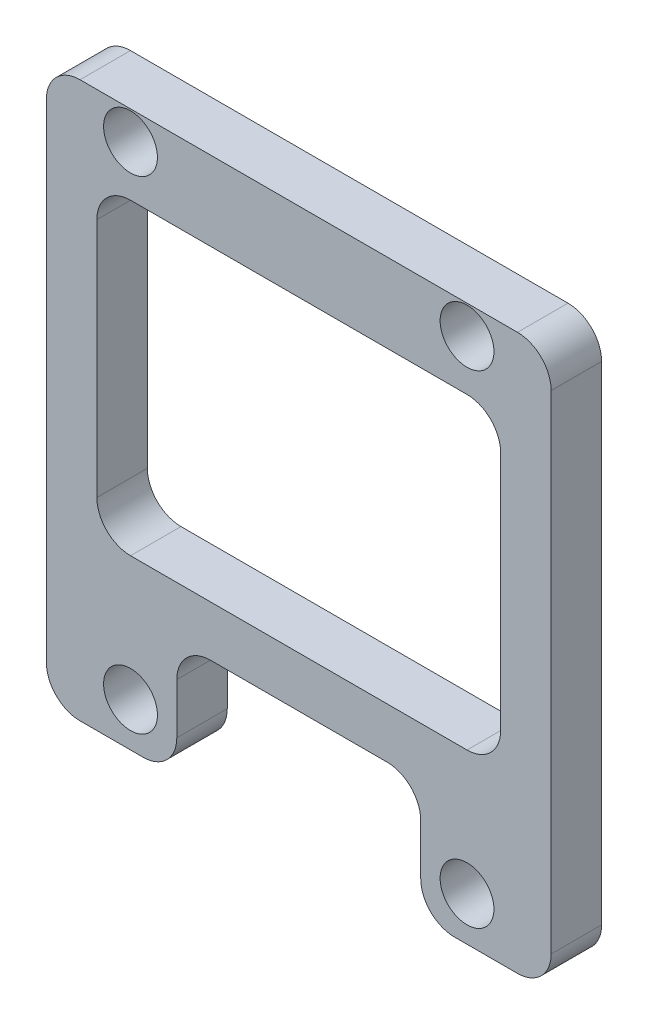
ISO-10303-21;
HEADER;
FILE_DESCRIPTION(('STEP AP214'),'2;1');
FILE_NAME('part.step','',(''),(''),'','','');
FILE_SCHEMA(('AUTOMOTIVE_DESIGN { 1 0 10303 214 1 1 1 1 }'));
ENDSEC;
DATA;
#1=APPLICATION_CONTEXT('core data for automotive mechanical design processes');
#2=APPLICATION_PROTOCOL_DEFINITION('international standard','automotive_design',2000,#1);
#3=PRODUCT_CONTEXT('',#1,'mechanical');
#4=PRODUCT('Part','Part','',(#3));
#5=PRODUCT_RELATED_PRODUCT_CATEGORY('part','',(#4));
#6=PRODUCT_DEFINITION_FORMATION('','',#4);
#7=PRODUCT_DEFINITION_CONTEXT('part definition',#1,'design');
#8=PRODUCT_DEFINITION('design','',#6,#7);
#9=PRODUCT_DEFINITION_SHAPE('','',#8);
#10=(LENGTH_UNIT() NAMED_UNIT(*) SI_UNIT(.MILLI.,.METRE.));
#11=(NAMED_UNIT(*) PLANE_ANGLE_UNIT() SI_UNIT($,.RADIAN.));
#12=(NAMED_UNIT(*) SI_UNIT($,.STERADIAN.) SOLID_ANGLE_UNIT());
#13=UNCERTAINTY_MEASURE_WITH_UNIT(LENGTH_MEASURE(1.E-05),#10,'distance_accuracy_value','');
#14=(GEOMETRIC_REPRESENTATION_CONTEXT(3) GLOBAL_UNCERTAINTY_ASSIGNED_CONTEXT((#13)) GLOBAL_UNIT_ASSIGNED_CONTEXT((#10,
#11,#12)) REPRESENTATION_CONTEXT('',''));
#15=CARTESIAN_POINT('',(0.,0.,0.));
#16=DIRECTION('',(0.,0.,1.));
#17=DIRECTION('',(1.,0.,0.));
#18=AXIS2_PLACEMENT_3D('',#15,#16,#17);
#19=CARTESIAN_POINT('',(0.,0.,3.));
#20=DIRECTION('',(0.,1.,0.));
#21=DIRECTION('',(0.,0.,1.));
#22=AXIS2_PLACEMENT_3D('',#19,#20,#21);
#23=PLANE('',#22);
#24=DIRECTION('',(1.,0.,0.));
#25=VECTOR('',#24,1.);
#26=CARTESIAN_POINT('',(0.,0.,0.));
#27=LINE('',#26,#25);
#28=CARTESIAN_POINT('',(2.,0.,0.));
#29=VERTEX_POINT('',#28);
#30=CARTESIAN_POINT('',(5.75,0.,0.));
#31=VERTEX_POINT('',#30);
#32=EDGE_CURVE('E226',#29,#31,#27,.T.);
#33=ORIENTED_EDGE('',*,*,#32,.T.);
#34=DIRECTION('',(0.,0.,1.));
#35=VECTOR('',#34,1.);
#36=CARTESIAN_POINT('',(5.75,0.,3.));
#37=LINE('',#36,#35);
#38=CARTESIAN_POINT('',(5.75,0.,3.));
#39=VERTEX_POINT('',#38);
#40=EDGE_CURVE('E289',#31,#39,#37,.T.);
#41=ORIENTED_EDGE('',*,*,#40,.T.);
#42=DIRECTION('',(1.,0.,0.));
#43=VECTOR('',#42,1.);
#44=CARTESIAN_POINT('',(0.,0.,3.));
#45=LINE('',#44,#43);
#46=CARTESIAN_POINT('',(2.,0.,3.));
#47=VERTEX_POINT('',#46);
#48=EDGE_CURVE('E403',#47,#39,#45,.T.);
#49=ORIENTED_EDGE('',*,*,#48,.F.);
#50=DIRECTION('',(0.,0.,-1.));
#51=VECTOR('',#50,1.);
#52=CARTESIAN_POINT('',(2.,0.,3.));
#53=LINE('',#52,#51);
#54=EDGE_CURVE('E266',#47,#29,#53,.T.);
#55=ORIENTED_EDGE('',*,*,#54,.T.);
#56=EDGE_LOOP('',(#33,#41,#49,#55));
#57=FACE_BOUND('',#56,.T.);
#58=ADVANCED_FACE('F34',(#57),#23,.F.);
#59=CARTESIAN_POINT('',(0.,0.,3.));
#60=DIRECTION('',(0.,0.,-1.));
#61=DIRECTION('',(-1.,0.,0.));
#62=AXIS2_PLACEMENT_3D('',#59,#60,#61);
#63=PLANE('',#62);
#64=DIRECTION('',(1.,0.,0.));
#65=VECTOR('',#64,1.);
#66=CARTESIAN_POINT('',(27.,10.,3.));
#67=LINE('',#66,#65);
#68=CARTESIAN_POINT('',(5.00000000000001,10.,3.));
#69=VERTEX_POINT('',#68);
#70=CARTESIAN_POINT('',(25.,10.,3.));
#71=VERTEX_POINT('',#70);
#72=EDGE_CURVE('E342',#69,#71,#67,.T.);
#73=ORIENTED_EDGE('',*,*,#72,.F.);
#74=CARTESIAN_POINT('',(5.,12.,3.));
#75=DIRECTION('',(0.,0.,-1.));
#76=DIRECTION('',(-1.,0.,0.));
#77=AXIS2_PLACEMENT_3D('',#74,#75,#76);
#78=CIRCLE('',#77,2.);
#79=CARTESIAN_POINT('',(3.,12.,3.));
#80=VERTEX_POINT('',#79);
#81=EDGE_CURVE('E42',#69,#80,#78,.T.);
#82=ORIENTED_EDGE('',*,*,#81,.T.);
#83=DIRECTION('',(0.,-1.,0.));
#84=VECTOR('',#83,1.);
#85=CARTESIAN_POINT('',(3.,10.,3.));
#86=LINE('',#85,#84);
#87=CARTESIAN_POINT('',(3.,26.3,3.));
#88=VERTEX_POINT('',#87);
#89=EDGE_CURVE('E340',#88,#80,#86,.T.);
#90=ORIENTED_EDGE('',*,*,#89,.F.);
#91=CARTESIAN_POINT('',(5.,26.3,3.));
#92=DIRECTION('',(0.,0.,-1.));
#93=DIRECTION('',(-1.,0.,0.));
#94=AXIS2_PLACEMENT_3D('',#91,#92,#93);
#95=CIRCLE('',#94,2.);
#96=CARTESIAN_POINT('',(5.00000000000001,28.3,3.));
#97=VERTEX_POINT('',#96);
#98=EDGE_CURVE('E316',#88,#97,#95,.T.);
#99=ORIENTED_EDGE('',*,*,#98,.T.);
#100=DIRECTION('',(-1.,0.,0.));
#101=VECTOR('',#100,1.);
#102=CARTESIAN_POINT('',(27.,28.3,3.));
#103=LINE('',#102,#101);
#104=CARTESIAN_POINT('',(25.,28.3,3.));
#105=VERTEX_POINT('',#104);
#106=EDGE_CURVE('E368',#105,#97,#103,.T.);
#107=ORIENTED_EDGE('',*,*,#106,.F.);
#108=CARTESIAN_POINT('',(25.,26.3,3.));
#109=DIRECTION('',(0.,0.,-1.));
#110=DIRECTION('',(-1.,0.,0.));
#111=AXIS2_PLACEMENT_3D('',#108,#109,#110);
#112=CIRCLE('',#111,2.);
#113=CARTESIAN_POINT('',(27.,26.3,3.));
#114=VERTEX_POINT('',#113);
#115=EDGE_CURVE('E320',#105,#114,#112,.T.);
#116=ORIENTED_EDGE('',*,*,#115,.T.);
#117=DIRECTION('',(0.,1.,0.));
#118=VECTOR('',#117,1.);
#119=CARTESIAN_POINT('',(27.,10.,3.));
#120=LINE('',#119,#118);
#121=CARTESIAN_POINT('',(27.,12.,3.));
#122=VERTEX_POINT('',#121);
#123=EDGE_CURVE('E375',#122,#114,#120,.T.);
#124=ORIENTED_EDGE('',*,*,#123,.F.);
#125=CARTESIAN_POINT('',(25.,12.,3.));
#126=DIRECTION('',(0.,0.,-1.));
#127=DIRECTION('',(-1.,0.,0.));
#128=AXIS2_PLACEMENT_3D('',#125,#126,#127);
#129=CIRCLE('',#128,2.);
#130=EDGE_CURVE('E324',#122,#71,#129,.T.);
#131=ORIENTED_EDGE('',*,*,#130,.T.);
#132=EDGE_LOOP('',(#73,#82,#90,#99,#107,#116,#124,#131));
#133=FACE_BOUND('',#132,.T.);
#134=ORIENTED_EDGE('',*,*,#48,.T.);
#135=CARTESIAN_POINT('',(5.75,2.,3.));
#136=DIRECTION('',(0.,0.,-1.));
#137=DIRECTION('',(-1.,0.,0.));
#138=AXIS2_PLACEMENT_3D('',#135,#136,#137);
#139=CIRCLE('',#138,2.);
#140=CARTESIAN_POINT('',(7.75,2.,3.));
#141=VERTEX_POINT('',#140);
#142=EDGE_CURVE('E294',#39,#141,#139,.F.);
#143=ORIENTED_EDGE('',*,*,#142,.T.);
#144=DIRECTION('',(0.,-1.,0.));
#145=VECTOR('',#144,1.);
#146=CARTESIAN_POINT('',(7.75,0.,3.));
#147=LINE('',#146,#145);
#148=CARTESIAN_POINT('',(7.75,5.,3.));
#149=VERTEX_POINT('',#148);
#150=EDGE_CURVE('E372',#149,#141,#147,.T.);
#151=ORIENTED_EDGE('',*,*,#150,.F.);
#152=CARTESIAN_POINT('',(9.75,5.,3.));
#153=DIRECTION('',(0.,0.,-1.));
#154=DIRECTION('',(-1.,0.,0.));
#155=AXIS2_PLACEMENT_3D('',#152,#153,#154);
#156=CIRCLE('',#155,2.);
#157=CARTESIAN_POINT('',(9.75,7.,3.));
#158=VERTEX_POINT('',#157);
#159=EDGE_CURVE('E328',#149,#158,#156,.T.);
#160=ORIENTED_EDGE('',*,*,#159,.T.);
#161=DIRECTION('',(-1.,0.,0.));
#162=VECTOR('',#161,1.);
#163=CARTESIAN_POINT('',(7.75,7.,3.));
#164=LINE('',#163,#162);
#165=CARTESIAN_POINT('',(20.25,7.,3.));
#166=VERTEX_POINT('',#165);
#167=EDGE_CURVE('E443',#166,#158,#164,.T.);
#168=ORIENTED_EDGE('',*,*,#167,.F.);
#169=CARTESIAN_POINT('',(20.25,5.,3.));
#170=DIRECTION('',(0.,0.,-1.));
#171=DIRECTION('',(-1.,0.,0.));
#172=AXIS2_PLACEMENT_3D('',#169,#170,#171);
#173=CIRCLE('',#172,2.);
#174=CARTESIAN_POINT('',(22.25,5.,3.));
#175=VERTEX_POINT('',#174);
#176=EDGE_CURVE('E332',#166,#175,#173,.T.);
#177=ORIENTED_EDGE('',*,*,#176,.T.);
#178=DIRECTION('',(0.,1.,0.));
#179=VECTOR('',#178,1.);
#180=CARTESIAN_POINT('',(22.25,0.,3.));
#181=LINE('',#180,#179);
#182=CARTESIAN_POINT('',(22.25,2.,3.));
#183=VERTEX_POINT('',#182);
#184=EDGE_CURVE('E438',#183,#175,#181,.T.);
#185=ORIENTED_EDGE('',*,*,#184,.F.);
#186=CARTESIAN_POINT('',(24.25,2.,3.));
#187=DIRECTION('',(0.,0.,-1.));
#188=DIRECTION('',(-1.,0.,0.));
#189=AXIS2_PLACEMENT_3D('',#186,#187,#188);
#190=CIRCLE('',#189,2.);
#191=CARTESIAN_POINT('',(24.25,0.,3.));
#192=VERTEX_POINT('',#191);
#193=EDGE_CURVE('E292',#183,#192,#190,.F.);
#194=ORIENTED_EDGE('',*,*,#193,.T.);
#195=CARTESIAN_POINT('',(28.,0.,3.));
#196=VERTEX_POINT('',#195);
#197=EDGE_CURVE('E402',#192,#196,#45,.T.);
#198=ORIENTED_EDGE('',*,*,#197,.T.);
#199=CARTESIAN_POINT('',(28.,2.,3.));
#200=DIRECTION('',(0.,0.,-1.));
#201=DIRECTION('',(-1.,0.,0.));
#202=AXIS2_PLACEMENT_3D('',#199,#200,#201);
#203=CIRCLE('',#202,2.);
#204=CARTESIAN_POINT('',(30.,2.,3.));
#205=VERTEX_POINT('',#204);
#206=EDGE_CURVE('E252',#196,#205,#203,.F.);
#207=ORIENTED_EDGE('',*,*,#206,.T.);
#208=DIRECTION('',(0.,1.,0.));
#209=VECTOR('',#208,1.);
#210=CARTESIAN_POINT('',(30.,0.,3.));
#211=LINE('',#210,#209);
#212=CARTESIAN_POINT('',(30.,31.,3.));
#213=VERTEX_POINT('',#212);
#214=EDGE_CURVE('E405',#205,#213,#211,.T.);
#215=ORIENTED_EDGE('',*,*,#214,.T.);
#216=CARTESIAN_POINT('',(28.,31.,3.));
#217=DIRECTION('',(0.,0.,-1.));
#218=DIRECTION('',(-1.,0.,0.));
#219=AXIS2_PLACEMENT_3D('',#216,#217,#218);
#220=CIRCLE('',#219,2.);
#221=CARTESIAN_POINT('',(28.,33.,3.));
#222=VERTEX_POINT('',#221);
#223=EDGE_CURVE('E254',#213,#222,#220,.F.);
#224=ORIENTED_EDGE('',*,*,#223,.T.);
#225=DIRECTION('',(-1.,0.,0.));
#226=VECTOR('',#225,1.);
#227=CARTESIAN_POINT('',(0.,33.,3.));
#228=LINE('',#227,#226);
#229=CARTESIAN_POINT('',(2.,33.,3.));
#230=VERTEX_POINT('',#229);
#231=EDGE_CURVE('E232',#222,#230,#228,.T.);
#232=ORIENTED_EDGE('',*,*,#231,.T.);
#233=CARTESIAN_POINT('',(2.,31.,3.));
#234=DIRECTION('',(0.,0.,-1.));
#235=DIRECTION('',(-1.,0.,0.));
#236=AXIS2_PLACEMENT_3D('',#233,#234,#235);
#237=CIRCLE('',#236,2.);
#238=CARTESIAN_POINT('',(0.,31.,3.));
#239=VERTEX_POINT('',#238);
#240=EDGE_CURVE('E256',#230,#239,#237,.F.);
#241=ORIENTED_EDGE('',*,*,#240,.T.);
#242=DIRECTION('',(0.,-1.,0.));
#243=VECTOR('',#242,1.);
#244=CARTESIAN_POINT('',(0.,0.,3.));
#245=LINE('',#244,#243);
#246=CARTESIAN_POINT('',(0.,2.,3.));
#247=VERTEX_POINT('',#246);
#248=EDGE_CURVE('E215',#239,#247,#245,.T.);
#249=ORIENTED_EDGE('',*,*,#248,.T.);
#250=CARTESIAN_POINT('',(2.,2.,3.));
#251=DIRECTION('',(0.,0.,-1.));
#252=DIRECTION('',(-1.,0.,0.));
#253=AXIS2_PLACEMENT_3D('',#250,#251,#252);
#254=CIRCLE('',#253,2.);
#255=EDGE_CURVE('E250',#247,#47,#254,.F.);
#256=ORIENTED_EDGE('',*,*,#255,.T.);
#257=EDGE_LOOP('',(#134,#143,#151,#160,#168,#177,#185,#194,#198,#207,#215,#224,#232,#241,#249,#256));
#258=FACE_BOUND('',#257,.T.);
#259=CARTESIAN_POINT('',(5.,31.3,3.));
#260=DIRECTION('',(0.,0.,1.));
#261=DIRECTION('',(1.,0.,0.));
#262=AXIS2_PLACEMENT_3D('',#259,#260,#261);
#263=CIRCLE('',#262,1.6);
#264=CARTESIAN_POINT('',(6.59999999999999,31.3,3.));
#265=VERTEX_POINT('',#264);
#266=EDGE_CURVE('E224',#265,#265,#263,.T.);
#267=ORIENTED_EDGE('',*,*,#266,.F.);
#268=EDGE_LOOP('',(#267));
#269=FACE_BOUND('',#268,.T.);
#270=CARTESIAN_POINT('',(25.,31.3,3.));
#271=DIRECTION('',(0.,0.,1.));
#272=DIRECTION('',(1.,0.,0.));
#273=AXIS2_PLACEMENT_3D('',#270,#271,#272);
#274=CIRCLE('',#273,1.6);
#275=CARTESIAN_POINT('',(26.6,31.3,3.));
#276=VERTEX_POINT('',#275);
#277=EDGE_CURVE('E394',#276,#276,#274,.T.);
#278=ORIENTED_EDGE('',*,*,#277,.F.);
#279=EDGE_LOOP('',(#278));
#280=FACE_BOUND('',#279,.T.);
#281=CARTESIAN_POINT('',(25.,2.6,3.));
#282=DIRECTION('',(0.,0.,1.));
#283=DIRECTION('',(1.,0.,0.));
#284=AXIS2_PLACEMENT_3D('',#281,#282,#283);
#285=CIRCLE('',#284,1.6);
#286=CARTESIAN_POINT('',(26.6,2.6,3.));
#287=VERTEX_POINT('',#286);
#288=EDGE_CURVE('E388',#287,#287,#285,.T.);
#289=ORIENTED_EDGE('',*,*,#288,.F.);
#290=EDGE_LOOP('',(#289));
#291=FACE_BOUND('',#290,.T.);
#292=CARTESIAN_POINT('',(5.,2.6,3.));
#293=DIRECTION('',(0.,0.,1.));
#294=DIRECTION('',(1.,0.,0.));
#295=AXIS2_PLACEMENT_3D('',#292,#293,#294);
#296=CIRCLE('',#295,1.6);
#297=CARTESIAN_POINT('',(6.6,2.6,3.));
#298=VERTEX_POINT('',#297);
#299=EDGE_CURVE('E380',#298,#298,#296,.T.);
#300=ORIENTED_EDGE('',*,*,#299,.F.);
#301=EDGE_LOOP('',(#300));
#302=FACE_BOUND('',#301,.T.);
#303=ADVANCED_FACE('F338',(#133,#258,#269,#280,#291,#302),#63,.F.);
#304=CARTESIAN_POINT('',(0.,0.,0.));
#305=DIRECTION('',(0.,0.,-1.));
#306=DIRECTION('',(-1.,0.,0.));
#307=AXIS2_PLACEMENT_3D('',#304,#305,#306);
#308=PLANE('',#307);
#309=DIRECTION('',(0.,-1.,0.));
#310=VECTOR('',#309,1.);
#311=CARTESIAN_POINT('',(7.75,0.,0.));
#312=LINE('',#311,#310);
#313=CARTESIAN_POINT('',(7.75,5.,0.));
#314=VERTEX_POINT('',#313);
#315=CARTESIAN_POINT('',(7.75,2.,0.));
#316=VERTEX_POINT('',#315);
#317=EDGE_CURVE('E445',#314,#316,#312,.T.);
#318=ORIENTED_EDGE('',*,*,#317,.T.);
#319=CARTESIAN_POINT('',(5.75,2.,0.));
#320=DIRECTION('',(0.,0.,-1.));
#321=DIRECTION('',(-1.,0.,0.));
#322=AXIS2_PLACEMENT_3D('',#319,#320,#321);
#323=CIRCLE('',#322,2.);
#324=EDGE_CURVE('E303',#316,#31,#323,.T.);
#325=ORIENTED_EDGE('',*,*,#324,.T.);
#326=ORIENTED_EDGE('',*,*,#32,.F.);
#327=CARTESIAN_POINT('',(2.,2.,0.));
#328=DIRECTION('',(0.,0.,-1.));
#329=DIRECTION('',(-1.,0.,0.));
#330=AXIS2_PLACEMENT_3D('',#327,#328,#329);
#331=CIRCLE('',#330,2.);
#332=CARTESIAN_POINT('',(0.,2.,0.));
#333=VERTEX_POINT('',#332);
#334=EDGE_CURVE('E216',#29,#333,#331,.T.);
#335=ORIENTED_EDGE('',*,*,#334,.T.);
#336=DIRECTION('',(0.,-1.,0.));
#337=VECTOR('',#336,1.);
#338=CARTESIAN_POINT('',(0.,0.,0.));
#339=LINE('',#338,#337);
#340=CARTESIAN_POINT('',(0.,31.,0.));
#341=VERTEX_POINT('',#340);
#342=EDGE_CURVE('E212',#341,#333,#339,.T.);
#343=ORIENTED_EDGE('',*,*,#342,.F.);
#344=CARTESIAN_POINT('',(2.,31.,0.));
#345=DIRECTION('',(0.,0.,-1.));
#346=DIRECTION('',(-1.,0.,0.));
#347=AXIS2_PLACEMENT_3D('',#344,#345,#346);
#348=CIRCLE('',#347,2.);
#349=CARTESIAN_POINT('',(2.,33.,0.));
#350=VERTEX_POINT('',#349);
#351=EDGE_CURVE('E196',#341,#350,#348,.T.);
#352=ORIENTED_EDGE('',*,*,#351,.T.);
#353=DIRECTION('',(-1.,0.,0.));
#354=VECTOR('',#353,1.);
#355=CARTESIAN_POINT('',(0.,33.,0.));
#356=LINE('',#355,#354);
#357=CARTESIAN_POINT('',(28.,33.,0.));
#358=VERTEX_POINT('',#357);
#359=EDGE_CURVE('E239',#358,#350,#356,.T.);
#360=ORIENTED_EDGE('',*,*,#359,.F.);
#361=CARTESIAN_POINT('',(28.,31.,0.));
#362=DIRECTION('',(0.,0.,-1.));
#363=DIRECTION('',(-1.,0.,0.));
#364=AXIS2_PLACEMENT_3D('',#361,#362,#363);
#365=CIRCLE('',#364,2.);
#366=CARTESIAN_POINT('',(30.,31.,0.));
#367=VERTEX_POINT('',#366);
#368=EDGE_CURVE('E206',#358,#367,#365,.T.);
#369=ORIENTED_EDGE('',*,*,#368,.T.);
#370=DIRECTION('',(0.,1.,0.));
#371=VECTOR('',#370,1.);
#372=CARTESIAN_POINT('',(30.,0.,0.));
#373=LINE('',#372,#371);
#374=CARTESIAN_POINT('',(30.,2.,0.));
#375=VERTEX_POINT('',#374);
#376=EDGE_CURVE('E236',#375,#367,#373,.T.);
#377=ORIENTED_EDGE('',*,*,#376,.F.);
#378=CARTESIAN_POINT('',(28.,2.,0.));
#379=DIRECTION('',(0.,0.,-1.));
#380=DIRECTION('',(-1.,0.,0.));
#381=AXIS2_PLACEMENT_3D('',#378,#379,#380);
#382=CIRCLE('',#381,2.);
#383=CARTESIAN_POINT('',(28.,0.,0.));
#384=VERTEX_POINT('',#383);
#385=EDGE_CURVE('E243',#375,#384,#382,.T.);
#386=ORIENTED_EDGE('',*,*,#385,.T.);
#387=CARTESIAN_POINT('',(24.25,0.,0.));
#388=VERTEX_POINT('',#387);
#389=EDGE_CURVE('E223',#388,#384,#27,.T.);
#390=ORIENTED_EDGE('',*,*,#389,.F.);
#391=CARTESIAN_POINT('',(24.25,2.,0.));
#392=DIRECTION('',(0.,0.,-1.));
#393=DIRECTION('',(-1.,0.,0.));
#394=AXIS2_PLACEMENT_3D('',#391,#392,#393);
#395=CIRCLE('',#394,2.);
#396=CARTESIAN_POINT('',(22.25,2.,0.));
#397=VERTEX_POINT('',#396);
#398=EDGE_CURVE('E301',#388,#397,#395,.T.);
#399=ORIENTED_EDGE('',*,*,#398,.T.);
#400=DIRECTION('',(0.,1.,0.));
#401=VECTOR('',#400,1.);
#402=CARTESIAN_POINT('',(22.25,0.,0.));
#403=LINE('',#402,#401);
#404=CARTESIAN_POINT('',(22.25,5.,0.));
#405=VERTEX_POINT('',#404);
#406=EDGE_CURVE('E440',#397,#405,#403,.T.);
#407=ORIENTED_EDGE('',*,*,#406,.T.);
#408=CARTESIAN_POINT('',(20.25,5.,0.));
#409=DIRECTION('',(0.,0.,-1.));
#410=DIRECTION('',(-1.,0.,0.));
#411=AXIS2_PLACEMENT_3D('',#408,#409,#410);
#412=CIRCLE('',#411,2.);
#413=CARTESIAN_POINT('',(20.25,7.,0.));
#414=VERTEX_POINT('',#413);
#415=EDGE_CURVE('E56',#405,#414,#412,.F.);
#416=ORIENTED_EDGE('',*,*,#415,.T.);
#417=DIRECTION('',(-1.,0.,0.));
#418=VECTOR('',#417,1.);
#419=CARTESIAN_POINT('',(7.75,7.,0.));
#420=LINE('',#419,#418);
#421=CARTESIAN_POINT('',(9.75,7.,0.));
#422=VERTEX_POINT('',#421);
#423=EDGE_CURVE('E387',#414,#422,#420,.T.);
#424=ORIENTED_EDGE('',*,*,#423,.T.);
#425=CARTESIAN_POINT('',(9.75,5.,0.));
#426=DIRECTION('',(0.,0.,-1.));
#427=DIRECTION('',(-1.,0.,0.));
#428=AXIS2_PLACEMENT_3D('',#425,#426,#427);
#429=CIRCLE('',#428,2.);
#430=EDGE_CURVE('E330',#422,#314,#429,.F.);
#431=ORIENTED_EDGE('',*,*,#430,.T.);
#432=EDGE_LOOP('',(#318,#325,#326,#335,#343,#352,#360,#369,#377,#386,#390,#399,#407,#416,#424,#431));
#433=FACE_BOUND('',#432,.T.);
#434=DIRECTION('',(-1.,0.,0.));
#435=VECTOR('',#434,1.);
#436=CARTESIAN_POINT('',(27.,28.3,0.));
#437=LINE('',#436,#435);
#438=CARTESIAN_POINT('',(25.,28.3,0.));
#439=VERTEX_POINT('',#438);
#440=CARTESIAN_POINT('',(5.00000000000001,28.3,0.));
#441=VERTEX_POINT('',#440);
#442=EDGE_CURVE('E366',#439,#441,#437,.T.);
#443=ORIENTED_EDGE('',*,*,#442,.T.);
#444=CARTESIAN_POINT('',(5.,26.3,0.));
#445=DIRECTION('',(0.,0.,-1.));
#446=DIRECTION('',(-1.,0.,0.));
#447=AXIS2_PLACEMENT_3D('',#444,#445,#446);
#448=CIRCLE('',#447,2.);
#449=CARTESIAN_POINT('',(3.,26.3,0.));
#450=VERTEX_POINT('',#449);
#451=EDGE_CURVE('E318',#441,#450,#448,.F.);
#452=ORIENTED_EDGE('',*,*,#451,.T.);
#453=DIRECTION('',(0.,-1.,0.));
#454=VECTOR('',#453,1.);
#455=CARTESIAN_POINT('',(3.,10.,0.));
#456=LINE('',#455,#454);
#457=CARTESIAN_POINT('',(3.,12.,0.));
#458=VERTEX_POINT('',#457);
#459=EDGE_CURVE('E359',#450,#458,#456,.T.);
#460=ORIENTED_EDGE('',*,*,#459,.T.);
#461=CARTESIAN_POINT('',(5.,12.,0.));
#462=DIRECTION('',(0.,0.,-1.));
#463=DIRECTION('',(-1.,0.,0.));
#464=AXIS2_PLACEMENT_3D('',#461,#462,#463);
#465=CIRCLE('',#464,2.);
#466=CARTESIAN_POINT('',(5.00000000000001,10.,0.));
#467=VERTEX_POINT('',#466);
#468=EDGE_CURVE('E11',#458,#467,#465,.F.);
#469=ORIENTED_EDGE('',*,*,#468,.T.);
#470=DIRECTION('',(1.,0.,0.));
#471=VECTOR('',#470,1.);
#472=CARTESIAN_POINT('',(27.,10.,0.));
#473=LINE('',#472,#471);
#474=CARTESIAN_POINT('',(25.,10.,0.));
#475=VERTEX_POINT('',#474);
#476=EDGE_CURVE('E357',#467,#475,#473,.T.);
#477=ORIENTED_EDGE('',*,*,#476,.T.);
#478=CARTESIAN_POINT('',(25.,12.,0.));
#479=DIRECTION('',(0.,0.,-1.));
#480=DIRECTION('',(-1.,0.,0.));
#481=AXIS2_PLACEMENT_3D('',#478,#479,#480);
#482=CIRCLE('',#481,2.);
#483=CARTESIAN_POINT('',(27.,12.,0.));
#484=VERTEX_POINT('',#483);
#485=EDGE_CURVE('E326',#475,#484,#482,.F.);
#486=ORIENTED_EDGE('',*,*,#485,.T.);
#487=DIRECTION('',(0.,1.,0.));
#488=VECTOR('',#487,1.);
#489=CARTESIAN_POINT('',(27.,10.,0.));
#490=LINE('',#489,#488);
#491=CARTESIAN_POINT('',(27.,26.3,0.));
#492=VERTEX_POINT('',#491);
#493=EDGE_CURVE('E363',#484,#492,#490,.T.);
#494=ORIENTED_EDGE('',*,*,#493,.T.);
#495=CARTESIAN_POINT('',(25.,26.3,0.));
#496=DIRECTION('',(0.,0.,-1.));
#497=DIRECTION('',(-1.,0.,0.));
#498=AXIS2_PLACEMENT_3D('',#495,#496,#497);
#499=CIRCLE('',#498,2.);
#500=EDGE_CURVE('E322',#492,#439,#499,.F.);
#501=ORIENTED_EDGE('',*,*,#500,.T.);
#502=EDGE_LOOP('',(#443,#452,#460,#469,#477,#486,#494,#501));
#503=FACE_BOUND('',#502,.T.);
#504=CARTESIAN_POINT('',(25.,2.6,0.));
#505=DIRECTION('',(0.,0.,1.));
#506=DIRECTION('',(1.,0.,0.));
#507=AXIS2_PLACEMENT_3D('',#504,#505,#506);
#508=CIRCLE('',#507,1.6);
#509=CARTESIAN_POINT('',(26.6,2.6,0.));
#510=VERTEX_POINT('',#509);
#511=EDGE_CURVE('E383',#510,#510,#508,.T.);
#512=ORIENTED_EDGE('',*,*,#511,.T.);
#513=EDGE_LOOP('',(#512));
#514=FACE_BOUND('',#513,.T.);
#515=CARTESIAN_POINT('',(5.,31.3,0.));
#516=DIRECTION('',(0.,0.,1.));
#517=DIRECTION('',(1.,0.,0.));
#518=AXIS2_PLACEMENT_3D('',#515,#516,#517);
#519=CIRCLE('',#518,1.6);
#520=CARTESIAN_POINT('',(6.59999999999999,31.3,0.));
#521=VERTEX_POINT('',#520);
#522=EDGE_CURVE('E229',#521,#521,#519,.T.);
#523=ORIENTED_EDGE('',*,*,#522,.T.);
#524=EDGE_LOOP('',(#523));
#525=FACE_BOUND('',#524,.T.);
#526=CARTESIAN_POINT('',(25.,31.3,0.));
#527=DIRECTION('',(0.,0.,1.));
#528=DIRECTION('',(1.,0.,0.));
#529=AXIS2_PLACEMENT_3D('',#526,#527,#528);
#530=CIRCLE('',#529,1.6);
#531=CARTESIAN_POINT('',(26.6,31.3,0.));
#532=VERTEX_POINT('',#531);
#533=EDGE_CURVE('E391',#532,#532,#530,.T.);
#534=ORIENTED_EDGE('',*,*,#533,.T.);
#535=EDGE_LOOP('',(#534));
#536=FACE_BOUND('',#535,.T.);
#537=CARTESIAN_POINT('',(5.,2.6,0.));
#538=DIRECTION('',(0.,0.,1.));
#539=DIRECTION('',(1.,0.,0.));
#540=AXIS2_PLACEMENT_3D('',#537,#538,#539);
#541=CIRCLE('',#540,1.6);
#542=CARTESIAN_POINT('',(6.6,2.6,0.));
#543=VERTEX_POINT('',#542);
#544=EDGE_CURVE('E384',#543,#543,#541,.T.);
#545=ORIENTED_EDGE('',*,*,#544,.T.);
#546=EDGE_LOOP('',(#545));
#547=FACE_BOUND('',#546,.T.);
#548=ADVANCED_FACE('F220',(#433,#503,#514,#525,#536,#547),#308,.T.);
#549=CARTESIAN_POINT('',(0.,0.,3.));
#550=DIRECTION('',(1.,0.,0.));
#551=DIRECTION('',(0.,0.,-1.));
#552=AXIS2_PLACEMENT_3D('',#549,#550,#551);
#553=PLANE('',#552);
#554=ORIENTED_EDGE('',*,*,#248,.F.);
#555=DIRECTION('',(0.,0.,-1.));
#556=VECTOR('',#555,1.);
#557=CARTESIAN_POINT('',(0.,31.,3.));
#558=LINE('',#557,#556);
#559=EDGE_CURVE('E200',#239,#341,#558,.T.);
#560=ORIENTED_EDGE('',*,*,#559,.T.);
#561=ORIENTED_EDGE('',*,*,#342,.T.);
#562=DIRECTION('',(0.,0.,-1.));
#563=VECTOR('',#562,1.);
#564=CARTESIAN_POINT('',(0.,2.,3.));
#565=LINE('',#564,#563);
#566=EDGE_CURVE('E217',#333,#247,#565,.F.);
#567=ORIENTED_EDGE('',*,*,#566,.T.);
#568=EDGE_LOOP('',(#554,#560,#561,#567));
#569=FACE_BOUND('',#568,.T.);
#570=ADVANCED_FACE('F211',(#569),#553,.F.);
#571=ORIENTED_EDGE('',*,*,#197,.F.);
#572=DIRECTION('',(0.,0.,1.));
#573=VECTOR('',#572,1.);
#574=CARTESIAN_POINT('',(24.25,0.,3.));
#575=LINE('',#574,#573);
#576=EDGE_CURVE('E314',#192,#388,#575,.F.);
#577=ORIENTED_EDGE('',*,*,#576,.T.);
#578=ORIENTED_EDGE('',*,*,#389,.T.);
#579=DIRECTION('',(0.,0.,-1.));
#580=VECTOR('',#579,1.);
#581=CARTESIAN_POINT('',(28.,0.,3.));
#582=LINE('',#581,#580);
#583=EDGE_CURVE('E263',#384,#196,#582,.F.);
#584=ORIENTED_EDGE('',*,*,#583,.T.);
#585=EDGE_LOOP('',(#571,#577,#578,#584));
#586=FACE_BOUND('',#585,.T.);
#587=ADVANCED_FACE('F480',(#586),#23,.F.);
#588=CARTESIAN_POINT('',(30.,0.,3.));
#589=DIRECTION('',(-1.,0.,0.));
#590=DIRECTION('',(0.,0.,1.));
#591=AXIS2_PLACEMENT_3D('',#588,#589,#590);
#592=PLANE('',#591);
#593=ORIENTED_EDGE('',*,*,#376,.T.);
#594=DIRECTION('',(0.,0.,-1.));
#595=VECTOR('',#594,1.);
#596=CARTESIAN_POINT('',(30.,31.,3.));
#597=LINE('',#596,#595);
#598=EDGE_CURVE('E261',#367,#213,#597,.F.);
#599=ORIENTED_EDGE('',*,*,#598,.T.);
#600=ORIENTED_EDGE('',*,*,#214,.F.);
#601=DIRECTION('',(0.,0.,-1.));
#602=VECTOR('',#601,1.);
#603=CARTESIAN_POINT('',(30.,2.,3.));
#604=LINE('',#603,#602);
#605=EDGE_CURVE('E258',#205,#375,#604,.T.);
#606=ORIENTED_EDGE('',*,*,#605,.T.);
#607=EDGE_LOOP('',(#593,#599,#600,#606));
#608=FACE_BOUND('',#607,.T.);
#609=ADVANCED_FACE('F420',(#608),#592,.F.);
#610=CARTESIAN_POINT('',(0.,33.,3.));
#611=DIRECTION('',(0.,-1.,0.));
#612=DIRECTION('',(1.,0.,0.));
#613=AXIS2_PLACEMENT_3D('',#610,#611,#612);
#614=PLANE('',#613);
#615=ORIENTED_EDGE('',*,*,#359,.T.);
#616=DIRECTION('',(0.,0.,-1.));
#617=VECTOR('',#616,1.);
#618=CARTESIAN_POINT('',(2.,33.,3.));
#619=LINE('',#618,#617);
#620=EDGE_CURVE('E201',#350,#230,#619,.F.);
#621=ORIENTED_EDGE('',*,*,#620,.T.);
#622=ORIENTED_EDGE('',*,*,#231,.F.);
#623=DIRECTION('',(0.,0.,-1.));
#624=VECTOR('',#623,1.);
#625=CARTESIAN_POINT('',(28.,33.,3.));
#626=LINE('',#625,#624);
#627=EDGE_CURVE('E205',#222,#358,#626,.T.);
#628=ORIENTED_EDGE('',*,*,#627,.T.);
#629=EDGE_LOOP('',(#615,#621,#622,#628));
#630=FACE_BOUND('',#629,.T.);
#631=ADVANCED_FACE('F414',(#630),#614,.F.);
#632=CARTESIAN_POINT('',(5.,31.3,3.));
#633=DIRECTION('',(0.,0.,-1.));
#634=DIRECTION('',(-1.,0.,0.));
#635=AXIS2_PLACEMENT_3D('',#632,#633,#634);
#636=CYLINDRICAL_SURFACE('',#635,1.6);
#637=ORIENTED_EDGE('',*,*,#266,.T.);
#638=EDGE_LOOP('',(#637));
#639=FACE_BOUND('',#638,.T.);
#640=ORIENTED_EDGE('',*,*,#522,.F.);
#641=EDGE_LOOP('',(#640));
#642=FACE_BOUND('',#641,.T.);
#643=ADVANCED_FACE('F692',(#639,#642),#636,.F.);
#644=CARTESIAN_POINT('',(25.,31.3,3.));
#645=DIRECTION('',(0.,0.,-1.));
#646=DIRECTION('',(-1.,0.,0.));
#647=AXIS2_PLACEMENT_3D('',#644,#645,#646);
#648=CYLINDRICAL_SURFACE('',#647,1.6);
#649=ORIENTED_EDGE('',*,*,#277,.T.);
#650=EDGE_LOOP('',(#649));
#651=FACE_BOUND('',#650,.T.);
#652=ORIENTED_EDGE('',*,*,#533,.F.);
#653=EDGE_LOOP('',(#652));
#654=FACE_BOUND('',#653,.T.);
#655=ADVANCED_FACE('F719',(#651,#654),#648,.F.);
#656=CARTESIAN_POINT('',(25.,2.6,3.));
#657=DIRECTION('',(0.,0.,-1.));
#658=DIRECTION('',(-1.,0.,0.));
#659=AXIS2_PLACEMENT_3D('',#656,#657,#658);
#660=CYLINDRICAL_SURFACE('',#659,1.6);
#661=ORIENTED_EDGE('',*,*,#288,.T.);
#662=EDGE_LOOP('',(#661));
#663=FACE_BOUND('',#662,.T.);
#664=ORIENTED_EDGE('',*,*,#511,.F.);
#665=EDGE_LOOP('',(#664));
#666=FACE_BOUND('',#665,.T.);
#667=ADVANCED_FACE('F709',(#663,#666),#660,.F.);
#668=CARTESIAN_POINT('',(5.,2.6,3.));
#669=DIRECTION('',(0.,0.,-1.));
#670=DIRECTION('',(-1.,0.,0.));
#671=AXIS2_PLACEMENT_3D('',#668,#669,#670);
#672=CYLINDRICAL_SURFACE('',#671,1.6);
#673=ORIENTED_EDGE('',*,*,#299,.T.);
#674=EDGE_LOOP('',(#673));
#675=FACE_BOUND('',#674,.T.);
#676=ORIENTED_EDGE('',*,*,#544,.F.);
#677=EDGE_LOOP('',(#676));
#678=FACE_BOUND('',#677,.T.);
#679=ADVANCED_FACE('F548',(#675,#678),#672,.F.);
#680=CARTESIAN_POINT('',(7.75,0.,0.));
#681=DIRECTION('',(-1.,0.,0.));
#682=DIRECTION('',(0.,-1.,0.));
#683=AXIS2_PLACEMENT_3D('',#680,#681,#682);
#684=PLANE('',#683);
#685=ORIENTED_EDGE('',*,*,#150,.T.);
#686=DIRECTION('',(0.,0.,1.));
#687=VECTOR('',#686,1.);
#688=CARTESIAN_POINT('',(7.75,2.,0.));
#689=LINE('',#688,#687);
#690=EDGE_CURVE('E299',#141,#316,#689,.F.);
#691=ORIENTED_EDGE('',*,*,#690,.T.);
#692=ORIENTED_EDGE('',*,*,#317,.F.);
#693=DIRECTION('',(0.,0.,1.));
#694=VECTOR('',#693,1.);
#695=CARTESIAN_POINT('',(7.75,5.,3.));
#696=LINE('',#695,#694);
#697=EDGE_CURVE('E296',#314,#149,#696,.T.);
#698=ORIENTED_EDGE('',*,*,#697,.T.);
#699=EDGE_LOOP('',(#685,#691,#692,#698));
#700=FACE_BOUND('',#699,.T.);
#701=ADVANCED_FACE('F543',(#700),#684,.F.);
#702=CARTESIAN_POINT('',(7.75,7.,0.));
#703=DIRECTION('',(0.,1.,0.));
#704=DIRECTION('',(-1.,0.,0.));
#705=AXIS2_PLACEMENT_3D('',#702,#703,#704);
#706=PLANE('',#705);
#707=ORIENTED_EDGE('',*,*,#167,.T.);
#708=DIRECTION('',(0.,0.,1.));
#709=VECTOR('',#708,1.);
#710=CARTESIAN_POINT('',(9.75,7.,0.));
#711=LINE('',#710,#709);
#712=EDGE_CURVE('E49',#158,#422,#711,.F.);
#713=ORIENTED_EDGE('',*,*,#712,.T.);
#714=ORIENTED_EDGE('',*,*,#423,.F.);
#715=DIRECTION('',(0.,0.,1.));
#716=VECTOR('',#715,1.);
#717=CARTESIAN_POINT('',(20.25,7.,3.));
#718=LINE('',#717,#716);
#719=EDGE_CURVE('E305',#414,#166,#718,.T.);
#720=ORIENTED_EDGE('',*,*,#719,.T.);
#721=EDGE_LOOP('',(#707,#713,#714,#720));
#722=FACE_BOUND('',#721,.T.);
#723=ADVANCED_FACE('F547',(#722),#706,.F.);
#724=CARTESIAN_POINT('',(22.25,0.,0.));
#725=DIRECTION('',(1.,0.,0.));
#726=DIRECTION('',(0.,1.,0.));
#727=AXIS2_PLACEMENT_3D('',#724,#725,#726);
#728=PLANE('',#727);
#729=ORIENTED_EDGE('',*,*,#184,.T.);
#730=DIRECTION('',(0.,0.,1.));
#731=VECTOR('',#730,1.);
#732=CARTESIAN_POINT('',(22.25,5.,0.));
#733=LINE('',#732,#731);
#734=EDGE_CURVE('E312',#175,#405,#733,.F.);
#735=ORIENTED_EDGE('',*,*,#734,.T.);
#736=ORIENTED_EDGE('',*,*,#406,.F.);
#737=DIRECTION('',(0.,0.,1.));
#738=VECTOR('',#737,1.);
#739=CARTESIAN_POINT('',(22.25,2.,0.));
#740=LINE('',#739,#738);
#741=EDGE_CURVE('E309',#397,#183,#740,.T.);
#742=ORIENTED_EDGE('',*,*,#741,.T.);
#743=EDGE_LOOP('',(#729,#735,#736,#742));
#744=FACE_BOUND('',#743,.T.);
#745=ADVANCED_FACE('F437',(#744),#728,.F.);
#746=CARTESIAN_POINT('',(3.,10.,0.));
#747=DIRECTION('',(-1.,0.,0.));
#748=DIRECTION('',(0.,0.,1.));
#749=AXIS2_PLACEMENT_3D('',#746,#747,#748);
#750=PLANE('',#749);
#751=ORIENTED_EDGE('',*,*,#459,.F.);
#752=DIRECTION('',(0.,0.,1.));
#753=VECTOR('',#752,1.);
#754=CARTESIAN_POINT('',(3.,26.3,3.));
#755=LINE('',#754,#753);
#756=EDGE_CURVE('E271',#450,#88,#755,.T.);
#757=ORIENTED_EDGE('',*,*,#756,.T.);
#758=ORIENTED_EDGE('',*,*,#89,.T.);
#759=DIRECTION('',(0.,0.,1.));
#760=VECTOR('',#759,1.);
#761=CARTESIAN_POINT('',(3.,12.,0.));
#762=LINE('',#761,#760);
#763=EDGE_CURVE('E269',#80,#458,#762,.F.);
#764=ORIENTED_EDGE('',*,*,#763,.T.);
#765=EDGE_LOOP('',(#751,#757,#758,#764));
#766=FACE_BOUND('',#765,.T.);
#767=ADVANCED_FACE('F348',(#766),#750,.F.);
#768=CARTESIAN_POINT('',(27.,28.3,0.));
#769=DIRECTION('',(0.,1.,0.));
#770=DIRECTION('',(0.,0.,1.));
#771=AXIS2_PLACEMENT_3D('',#768,#769,#770);
#772=PLANE('',#771);
#773=ORIENTED_EDGE('',*,*,#106,.T.);
#774=DIRECTION('',(0.,0.,1.));
#775=VECTOR('',#774,1.);
#776=CARTESIAN_POINT('',(5.,28.3,0.));
#777=LINE('',#776,#775);
#778=EDGE_CURVE('E277',#97,#441,#777,.F.);
#779=ORIENTED_EDGE('',*,*,#778,.T.);
#780=ORIENTED_EDGE('',*,*,#442,.F.);
#781=DIRECTION('',(0.,0.,1.));
#782=VECTOR('',#781,1.);
#783=CARTESIAN_POINT('',(25.,28.3,3.));
#784=LINE('',#783,#782);
#785=EDGE_CURVE('E274',#439,#105,#784,.T.);
#786=ORIENTED_EDGE('',*,*,#785,.T.);
#787=EDGE_LOOP('',(#773,#779,#780,#786));
#788=FACE_BOUND('',#787,.T.);
#789=ADVANCED_FACE('F574',(#788),#772,.F.);
#790=CARTESIAN_POINT('',(27.,10.,0.));
#791=DIRECTION('',(1.,0.,0.));
#792=DIRECTION('',(0.,0.,-1.));
#793=AXIS2_PLACEMENT_3D('',#790,#791,#792);
#794=PLANE('',#793);
#795=ORIENTED_EDGE('',*,*,#123,.T.);
#796=DIRECTION('',(0.,0.,1.));
#797=VECTOR('',#796,1.);
#798=CARTESIAN_POINT('',(27.,26.3,0.));
#799=LINE('',#798,#797);
#800=EDGE_CURVE('E282',#114,#492,#799,.F.);
#801=ORIENTED_EDGE('',*,*,#800,.T.);
#802=ORIENTED_EDGE('',*,*,#493,.F.);
#803=DIRECTION('',(0.,0.,1.));
#804=VECTOR('',#803,1.);
#805=CARTESIAN_POINT('',(27.,12.,3.));
#806=LINE('',#805,#804);
#807=EDGE_CURVE('E279',#484,#122,#806,.T.);
#808=ORIENTED_EDGE('',*,*,#807,.T.);
#809=EDGE_LOOP('',(#795,#801,#802,#808));
#810=FACE_BOUND('',#809,.T.);
#811=ADVANCED_FACE('F583',(#810),#794,.F.);
#812=CARTESIAN_POINT('',(27.,10.,0.));
#813=DIRECTION('',(0.,-1.,0.));
#814=DIRECTION('',(0.,0.,-1.));
#815=AXIS2_PLACEMENT_3D('',#812,#813,#814);
#816=PLANE('',#815);
#817=ORIENTED_EDGE('',*,*,#72,.T.);
#818=DIRECTION('',(0.,0.,1.));
#819=VECTOR('',#818,1.);
#820=CARTESIAN_POINT('',(25.,10.,0.));
#821=LINE('',#820,#819);
#822=EDGE_CURVE('E287',#71,#475,#821,.F.);
#823=ORIENTED_EDGE('',*,*,#822,.T.);
#824=ORIENTED_EDGE('',*,*,#476,.F.);
#825=DIRECTION('',(0.,0.,1.));
#826=VECTOR('',#825,1.);
#827=CARTESIAN_POINT('',(5.,10.,3.));
#828=LINE('',#827,#826);
#829=EDGE_CURVE('E284',#467,#69,#828,.T.);
#830=ORIENTED_EDGE('',*,*,#829,.T.);
#831=EDGE_LOOP('',(#817,#823,#824,#830));
#832=FACE_BOUND('',#831,.T.);
#833=ADVANCED_FACE('F361',(#832),#816,.F.);
#834=CARTESIAN_POINT('',(2.,31.,3.));
#835=DIRECTION('',(0.,0.,-1.));
#836=DIRECTION('',(-1.,0.,0.));
#837=AXIS2_PLACEMENT_3D('',#834,#835,#836);
#838=CYLINDRICAL_SURFACE('',#837,2.);
#839=ORIENTED_EDGE('',*,*,#240,.F.);
#840=ORIENTED_EDGE('',*,*,#620,.F.);
#841=ORIENTED_EDGE('',*,*,#351,.F.);
#842=ORIENTED_EDGE('',*,*,#559,.F.);
#843=EDGE_LOOP('',(#839,#840,#841,#842));
#844=FACE_BOUND('',#843,.T.);
#845=ADVANCED_FACE('F199',(#844),#838,.T.);
#846=CARTESIAN_POINT('',(28.,31.,3.));
#847=DIRECTION('',(0.,0.,-1.));
#848=DIRECTION('',(-1.,0.,0.));
#849=AXIS2_PLACEMENT_3D('',#846,#847,#848);
#850=CYLINDRICAL_SURFACE('',#849,2.);
#851=ORIENTED_EDGE('',*,*,#223,.F.);
#852=ORIENTED_EDGE('',*,*,#598,.F.);
#853=ORIENTED_EDGE('',*,*,#368,.F.);
#854=ORIENTED_EDGE('',*,*,#627,.F.);
#855=EDGE_LOOP('',(#851,#852,#853,#854));
#856=FACE_BOUND('',#855,.T.);
#857=ADVANCED_FACE('F416',(#856),#850,.T.);
#858=CARTESIAN_POINT('',(28.,2.,3.));
#859=DIRECTION('',(0.,0.,-1.));
#860=DIRECTION('',(-1.,0.,0.));
#861=AXIS2_PLACEMENT_3D('',#858,#859,#860);
#862=CYLINDRICAL_SURFACE('',#861,2.);
#863=ORIENTED_EDGE('',*,*,#206,.F.);
#864=ORIENTED_EDGE('',*,*,#583,.F.);
#865=ORIENTED_EDGE('',*,*,#385,.F.);
#866=ORIENTED_EDGE('',*,*,#605,.F.);
#867=EDGE_LOOP('',(#863,#864,#865,#866));
#868=FACE_BOUND('',#867,.T.);
#869=ADVANCED_FACE('F424',(#868),#862,.T.);
#870=CARTESIAN_POINT('',(2.,2.,3.));
#871=DIRECTION('',(0.,0.,-1.));
#872=DIRECTION('',(-1.,0.,0.));
#873=AXIS2_PLACEMENT_3D('',#870,#871,#872);
#874=CYLINDRICAL_SURFACE('',#873,2.);
#875=ORIENTED_EDGE('',*,*,#255,.F.);
#876=ORIENTED_EDGE('',*,*,#566,.F.);
#877=ORIENTED_EDGE('',*,*,#334,.F.);
#878=ORIENTED_EDGE('',*,*,#54,.F.);
#879=EDGE_LOOP('',(#875,#876,#877,#878));
#880=FACE_BOUND('',#879,.T.);
#881=ADVANCED_FACE('F466',(#880),#874,.T.);
#882=CARTESIAN_POINT('',(5.,26.3,0.));
#883=DIRECTION('',(0.,0.,-1.));
#884=DIRECTION('',(-1.,0.,0.));
#885=AXIS2_PLACEMENT_3D('',#882,#883,#884);
#886=CYLINDRICAL_SURFACE('',#885,2.);
#887=ORIENTED_EDGE('',*,*,#451,.F.);
#888=ORIENTED_EDGE('',*,*,#778,.F.);
#889=ORIENTED_EDGE('',*,*,#98,.F.);
#890=ORIENTED_EDGE('',*,*,#756,.F.);
#891=EDGE_LOOP('',(#887,#888,#889,#890));
#892=FACE_BOUND('',#891,.T.);
#893=ADVANCED_FACE('F468',(#892),#886,.F.);
#894=CARTESIAN_POINT('',(25.,26.3,0.));
#895=DIRECTION('',(0.,0.,-1.));
#896=DIRECTION('',(-1.,0.,0.));
#897=AXIS2_PLACEMENT_3D('',#894,#895,#896);
#898=CYLINDRICAL_SURFACE('',#897,2.);
#899=ORIENTED_EDGE('',*,*,#500,.F.);
#900=ORIENTED_EDGE('',*,*,#800,.F.);
#901=ORIENTED_EDGE('',*,*,#115,.F.);
#902=ORIENTED_EDGE('',*,*,#785,.F.);
#903=EDGE_LOOP('',(#899,#900,#901,#902));
#904=FACE_BOUND('',#903,.T.);
#905=ADVANCED_FACE('F474',(#904),#898,.F.);
#906=CARTESIAN_POINT('',(25.,12.,0.));
#907=DIRECTION('',(0.,0.,-1.));
#908=DIRECTION('',(-1.,0.,0.));
#909=AXIS2_PLACEMENT_3D('',#906,#907,#908);
#910=CYLINDRICAL_SURFACE('',#909,2.);
#911=ORIENTED_EDGE('',*,*,#485,.F.);
#912=ORIENTED_EDGE('',*,*,#822,.F.);
#913=ORIENTED_EDGE('',*,*,#130,.F.);
#914=ORIENTED_EDGE('',*,*,#807,.F.);
#915=EDGE_LOOP('',(#911,#912,#913,#914));
#916=FACE_BOUND('',#915,.T.);
#917=ADVANCED_FACE('F615',(#916),#910,.F.);
#918=CARTESIAN_POINT('',(5.75,2.,3.));
#919=DIRECTION('',(0.,0.,1.));
#920=DIRECTION('',(1.,0.,0.));
#921=AXIS2_PLACEMENT_3D('',#918,#919,#920);
#922=CYLINDRICAL_SURFACE('',#921,2.);
#923=ORIENTED_EDGE('',*,*,#324,.F.);
#924=ORIENTED_EDGE('',*,*,#690,.F.);
#925=ORIENTED_EDGE('',*,*,#142,.F.);
#926=ORIENTED_EDGE('',*,*,#40,.F.);
#927=EDGE_LOOP('',(#923,#924,#925,#926));
#928=FACE_BOUND('',#927,.T.);
#929=ADVANCED_FACE('F459',(#928),#922,.T.);
#930=CARTESIAN_POINT('',(9.75,5.,0.));
#931=DIRECTION('',(0.,0.,-1.));
#932=DIRECTION('',(-1.,0.,0.));
#933=AXIS2_PLACEMENT_3D('',#930,#931,#932);
#934=CYLINDRICAL_SURFACE('',#933,2.);
#935=ORIENTED_EDGE('',*,*,#430,.F.);
#936=ORIENTED_EDGE('',*,*,#712,.F.);
#937=ORIENTED_EDGE('',*,*,#159,.F.);
#938=ORIENTED_EDGE('',*,*,#697,.F.);
#939=EDGE_LOOP('',(#935,#936,#937,#938));
#940=FACE_BOUND('',#939,.T.);
#941=ADVANCED_FACE('F634',(#940),#934,.F.);
#942=CARTESIAN_POINT('',(20.25,5.,0.));
#943=DIRECTION('',(0.,0.,-1.));
#944=DIRECTION('',(-1.,0.,0.));
#945=AXIS2_PLACEMENT_3D('',#942,#943,#944);
#946=CYLINDRICAL_SURFACE('',#945,2.);
#947=ORIENTED_EDGE('',*,*,#415,.F.);
#948=ORIENTED_EDGE('',*,*,#734,.F.);
#949=ORIENTED_EDGE('',*,*,#176,.F.);
#950=ORIENTED_EDGE('',*,*,#719,.F.);
#951=EDGE_LOOP('',(#947,#948,#949,#950));
#952=FACE_BOUND('',#951,.T.);
#953=ADVANCED_FACE('F643',(#952),#946,.F.);
#954=CARTESIAN_POINT('',(24.25,2.,0.));
#955=DIRECTION('',(0.,0.,1.));
#956=DIRECTION('',(1.,0.,0.));
#957=AXIS2_PLACEMENT_3D('',#954,#955,#956);
#958=CYLINDRICAL_SURFACE('',#957,2.);
#959=ORIENTED_EDGE('',*,*,#398,.F.);
#960=ORIENTED_EDGE('',*,*,#576,.F.);
#961=ORIENTED_EDGE('',*,*,#193,.F.);
#962=ORIENTED_EDGE('',*,*,#741,.F.);
#963=EDGE_LOOP('',(#959,#960,#961,#962));
#964=FACE_BOUND('',#963,.T.);
#965=ADVANCED_FACE('F433',(#964),#958,.T.);
#966=CARTESIAN_POINT('',(5.,12.,0.));
#967=DIRECTION('',(0.,0.,-1.));
#968=DIRECTION('',(-1.,0.,0.));
#969=AXIS2_PLACEMENT_3D('',#966,#967,#968);
#970=CYLINDRICAL_SURFACE('',#969,2.);
#971=ORIENTED_EDGE('',*,*,#468,.F.);
#972=ORIENTED_EDGE('',*,*,#763,.F.);
#973=ORIENTED_EDGE('',*,*,#81,.F.);
#974=ORIENTED_EDGE('',*,*,#829,.F.);
#975=EDGE_LOOP('',(#971,#972,#973,#974));
#976=FACE_BOUND('',#975,.T.);
#977=ADVANCED_FACE('F36',(#976),#970,.F.);
#978=CLOSED_SHELL('',(#58,#303,#548,#570,#587,#609,#631,#643,#655,#667,#679,#701,#723,#745,#767,
#789,#811,#833,#845,#857,#869,#881,#893,#905,#917,#929,#941,#953,#965,#977));
#979=MANIFOLD_SOLID_BREP('B2',#978);
#980=ADVANCED_BREP_SHAPE_REPRESENTATION('',(#18,#979),#14);
#981=SHAPE_DEFINITION_REPRESENTATION(#9,#980);
ENDSEC;
END-ISO-10303-21;
